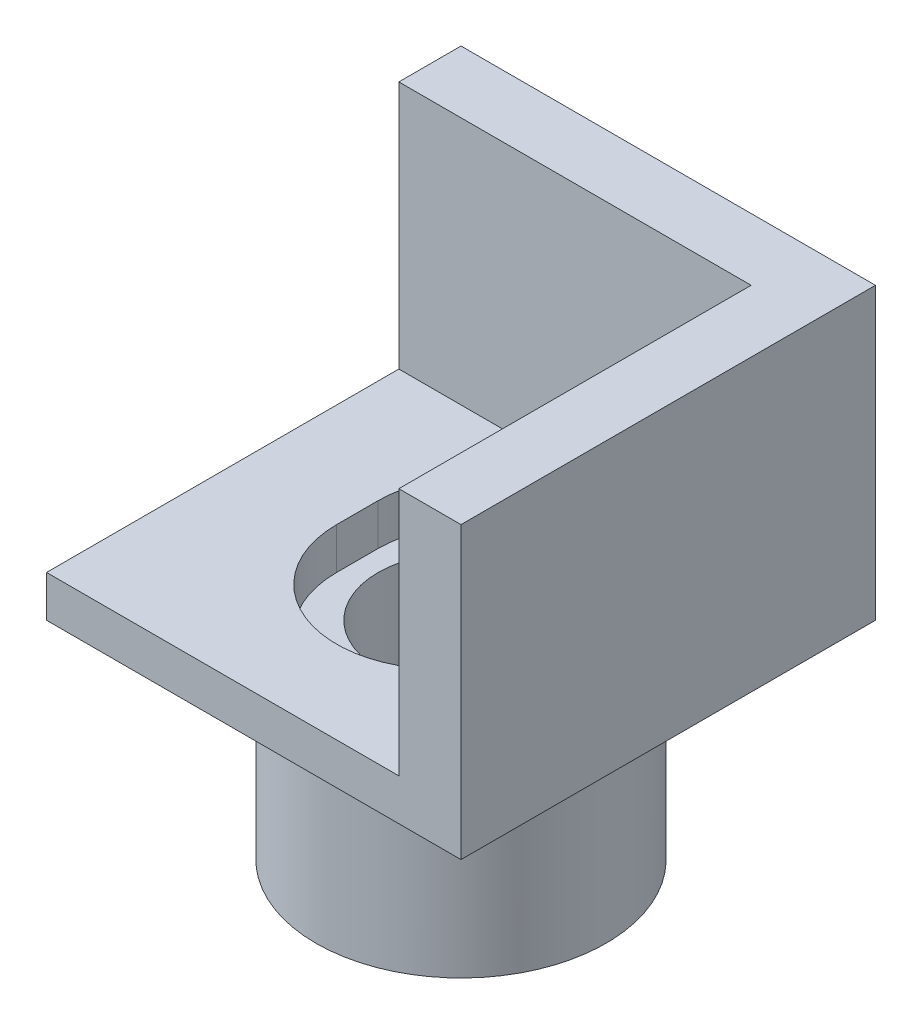
ISO-10303-21;
HEADER;
FILE_DESCRIPTION(('STEP AP214'),'2;1');
FILE_NAME('part.step','',(''),(''),'','','');
FILE_SCHEMA(('AUTOMOTIVE_DESIGN { 1 0 10303 214 1 1 1 1 }'));
ENDSEC;
DATA;
#1=APPLICATION_CONTEXT('core data for automotive mechanical design processes');
#2=APPLICATION_PROTOCOL_DEFINITION('international standard','automotive_design',2000,#1);
#3=PRODUCT_CONTEXT('',#1,'mechanical');
#4=PRODUCT('Part','Part','',(#3));
#5=PRODUCT_RELATED_PRODUCT_CATEGORY('part','',(#4));
#6=PRODUCT_DEFINITION_FORMATION('','',#4);
#7=PRODUCT_DEFINITION_CONTEXT('part definition',#1,'design');
#8=PRODUCT_DEFINITION('design','',#6,#7);
#9=PRODUCT_DEFINITION_SHAPE('','',#8);
#10=(LENGTH_UNIT() NAMED_UNIT(*) SI_UNIT(.MILLI.,.METRE.));
#11=(NAMED_UNIT(*) PLANE_ANGLE_UNIT() SI_UNIT($,.RADIAN.));
#12=(NAMED_UNIT(*) SI_UNIT($,.STERADIAN.) SOLID_ANGLE_UNIT());
#13=UNCERTAINTY_MEASURE_WITH_UNIT(LENGTH_MEASURE(1.E-05),#10,'distance_accuracy_value','');
#14=(GEOMETRIC_REPRESENTATION_CONTEXT(3) GLOBAL_UNCERTAINTY_ASSIGNED_CONTEXT((#13)) GLOBAL_UNIT_ASSIGNED_CONTEXT((#10,
#11,#12)) REPRESENTATION_CONTEXT('',''));
#15=CARTESIAN_POINT('',(0.,0.,0.));
#16=DIRECTION('',(0.,0.,1.));
#17=DIRECTION('',(1.,0.,0.));
#18=AXIS2_PLACEMENT_3D('',#15,#16,#17);
#19=CARTESIAN_POINT('',(-5.,1.,-5.));
#20=DIRECTION('',(1.,0.,0.));
#21=DIRECTION('',(0.,0.,-1.));
#22=AXIS2_PLACEMENT_3D('',#19,#20,#21);
#23=PLANE('',#22);
#24=DIRECTION('',(0.,0.,1.));
#25=VECTOR('',#24,1.);
#26=CARTESIAN_POINT('',(-5.,0.,-5.));
#27=LINE('',#26,#25);
#28=CARTESIAN_POINT('',(-5.,0.,-5.));
#29=VERTEX_POINT('',#28);
#30=CARTESIAN_POINT('',(-5.,0.,5.));
#31=VERTEX_POINT('',#30);
#32=EDGE_CURVE('E183',#29,#31,#27,.T.);
#33=ORIENTED_EDGE('',*,*,#32,.T.);
#34=DIRECTION('',(0.,-1.,0.));
#35=VECTOR('',#34,1.);
#36=CARTESIAN_POINT('',(-5.,1.,5.));
#37=LINE('',#36,#35);
#38=CARTESIAN_POINT('',(-5.,1.,5.));
#39=VERTEX_POINT('',#38);
#40=EDGE_CURVE('E125',#39,#31,#37,.T.);
#41=ORIENTED_EDGE('',*,*,#40,.F.);
#42=DIRECTION('',(0.,0.,1.));
#43=VECTOR('',#42,1.);
#44=CARTESIAN_POINT('',(-5.,1.,-5.));
#45=LINE('',#44,#43);
#46=CARTESIAN_POINT('',(-5.,1.,-3.5));
#47=VERTEX_POINT('',#46);
#48=EDGE_CURVE('E190',#47,#39,#45,.T.);
#49=ORIENTED_EDGE('',*,*,#48,.F.);
#50=DIRECTION('',(0.,-1.,0.));
#51=VECTOR('',#50,1.);
#52=CARTESIAN_POINT('',(-5.,7.,-3.5));
#53=LINE('',#52,#51);
#54=CARTESIAN_POINT('',(-5.,7.,-3.5));
#55=VERTEX_POINT('',#54);
#56=EDGE_CURVE('E157',#55,#47,#53,.T.);
#57=ORIENTED_EDGE('',*,*,#56,.F.);
#58=DIRECTION('',(0.,0.,1.));
#59=VECTOR('',#58,1.);
#60=CARTESIAN_POINT('',(-5.,7.,-3.5));
#61=LINE('',#60,#59);
#62=CARTESIAN_POINT('',(-5.,7.,-5.));
#63=VERTEX_POINT('',#62);
#64=EDGE_CURVE('E146',#63,#55,#61,.T.);
#65=ORIENTED_EDGE('',*,*,#64,.F.);
#66=DIRECTION('',(0.,-1.,0.));
#67=VECTOR('',#66,1.);
#68=CARTESIAN_POINT('',(-5.,1.,-5.));
#69=LINE('',#68,#67);
#70=EDGE_CURVE('E194',#63,#29,#69,.T.);
#71=ORIENTED_EDGE('',*,*,#70,.T.);
#72=EDGE_LOOP('',(#33,#41,#49,#57,#65,#71));
#73=FACE_BOUND('',#72,.T.);
#74=ADVANCED_FACE('F34',(#73),#23,.F.);
#75=CARTESIAN_POINT('',(-5.,1.,5.));
#76=DIRECTION('',(0.,0.,-1.));
#77=DIRECTION('',(-1.,0.,0.));
#78=AXIS2_PLACEMENT_3D('',#75,#76,#77);
#79=PLANE('',#78);
#80=DIRECTION('',(1.,0.,0.));
#81=VECTOR('',#80,1.);
#82=CARTESIAN_POINT('',(-5.,0.,5.));
#83=LINE('',#82,#81);
#84=CARTESIAN_POINT('',(5.,0.,5.));
#85=VERTEX_POINT('',#84);
#86=EDGE_CURVE('E122',#31,#85,#83,.T.);
#87=ORIENTED_EDGE('',*,*,#86,.T.);
#88=DIRECTION('',(0.,-1.,0.));
#89=VECTOR('',#88,1.);
#90=CARTESIAN_POINT('',(5.,1.,5.));
#91=LINE('',#90,#89);
#92=CARTESIAN_POINT('',(5.,7.,5.));
#93=VERTEX_POINT('',#92);
#94=EDGE_CURVE('E115',#93,#85,#91,.T.);
#95=ORIENTED_EDGE('',*,*,#94,.F.);
#96=DIRECTION('',(1.,0.,0.));
#97=VECTOR('',#96,1.);
#98=CARTESIAN_POINT('',(5.,7.,5.));
#99=LINE('',#98,#97);
#100=CARTESIAN_POINT('',(3.5,7.,5.));
#101=VERTEX_POINT('',#100);
#102=EDGE_CURVE('E120',#101,#93,#99,.T.);
#103=ORIENTED_EDGE('',*,*,#102,.F.);
#104=DIRECTION('',(0.,-1.,0.));
#105=VECTOR('',#104,1.);
#106=CARTESIAN_POINT('',(3.5,7.,5.));
#107=LINE('',#106,#105);
#108=CARTESIAN_POINT('',(3.5,1.,5.));
#109=VERTEX_POINT('',#108);
#110=EDGE_CURVE('E151',#101,#109,#107,.T.);
#111=ORIENTED_EDGE('',*,*,#110,.T.);
#112=DIRECTION('',(1.,0.,0.));
#113=VECTOR('',#112,1.);
#114=CARTESIAN_POINT('',(-5.,1.,5.));
#115=LINE('',#114,#113);
#116=EDGE_CURVE('E48',#39,#109,#115,.T.);
#117=ORIENTED_EDGE('',*,*,#116,.F.);
#118=ORIENTED_EDGE('',*,*,#40,.T.);
#119=EDGE_LOOP('',(#87,#95,#103,#111,#117,#118));
#120=FACE_BOUND('',#119,.T.);
#121=ADVANCED_FACE('F117',(#120),#79,.F.);
#122=CARTESIAN_POINT('',(5.,1.,-5.));
#123=DIRECTION('',(-1.,0.,0.));
#124=DIRECTION('',(0.,0.,1.));
#125=AXIS2_PLACEMENT_3D('',#122,#123,#124);
#126=PLANE('',#125);
#127=DIRECTION('',(0.,0.,-1.));
#128=VECTOR('',#127,1.);
#129=CARTESIAN_POINT('',(5.,0.,-5.));
#130=LINE('',#129,#128);
#131=CARTESIAN_POINT('',(5.,0.,-5.));
#132=VERTEX_POINT('',#131);
#133=EDGE_CURVE('E198',#85,#132,#130,.T.);
#134=ORIENTED_EDGE('',*,*,#133,.T.);
#135=DIRECTION('',(0.,-1.,0.));
#136=VECTOR('',#135,1.);
#137=CARTESIAN_POINT('',(5.,1.,-5.));
#138=LINE('',#137,#136);
#139=CARTESIAN_POINT('',(5.,7.,-5.));
#140=VERTEX_POINT('',#139);
#141=EDGE_CURVE('E126',#140,#132,#138,.T.);
#142=ORIENTED_EDGE('',*,*,#141,.F.);
#143=DIRECTION('',(0.,0.,-1.));
#144=VECTOR('',#143,1.);
#145=CARTESIAN_POINT('',(5.,7.,5.));
#146=LINE('',#145,#144);
#147=EDGE_CURVE('E129',#93,#140,#146,.T.);
#148=ORIENTED_EDGE('',*,*,#147,.F.);
#149=ORIENTED_EDGE('',*,*,#94,.T.);
#150=EDGE_LOOP('',(#134,#142,#148,#149));
#151=FACE_BOUND('',#150,.T.);
#152=ADVANCED_FACE('F130',(#151),#126,.F.);
#153=CARTESIAN_POINT('',(-5.,1.,-5.));
#154=DIRECTION('',(0.,0.,1.));
#155=DIRECTION('',(1.,0.,0.));
#156=AXIS2_PLACEMENT_3D('',#153,#154,#155);
#157=PLANE('',#156);
#158=DIRECTION('',(-1.,0.,0.));
#159=VECTOR('',#158,1.);
#160=CARTESIAN_POINT('',(-5.,0.,-5.));
#161=LINE('',#160,#159);
#162=EDGE_CURVE('E192',#132,#29,#161,.T.);
#163=ORIENTED_EDGE('',*,*,#162,.T.);
#164=ORIENTED_EDGE('',*,*,#70,.F.);
#165=DIRECTION('',(-1.,0.,0.));
#166=VECTOR('',#165,1.);
#167=CARTESIAN_POINT('',(5.,7.,-5.));
#168=LINE('',#167,#166);
#169=EDGE_CURVE('E135',#140,#63,#168,.T.);
#170=ORIENTED_EDGE('',*,*,#169,.F.);
#171=ORIENTED_EDGE('',*,*,#141,.T.);
#172=EDGE_LOOP('',(#163,#164,#170,#171));
#173=FACE_BOUND('',#172,.T.);
#174=ADVANCED_FACE('F261',(#173),#157,.F.);
#175=CARTESIAN_POINT('',(0.,1.,0.));
#176=DIRECTION('',(0.,1.,0.));
#177=DIRECTION('',(0.,0.,1.));
#178=AXIS2_PLACEMENT_3D('',#175,#176,#177);
#179=PLANE('',#178);
#180=DIRECTION('',(0.,0.,1.));
#181=VECTOR('',#180,1.);
#182=CARTESIAN_POINT('',(3.5,1.,5.));
#183=LINE('',#182,#181);
#184=CARTESIAN_POINT('',(3.5,1.,-3.5));
#185=VERTEX_POINT('',#184);
#186=EDGE_CURVE('E141',#185,#109,#183,.T.);
#187=ORIENTED_EDGE('',*,*,#186,.F.);
#188=DIRECTION('',(1.,0.,0.));
#189=VECTOR('',#188,1.);
#190=CARTESIAN_POINT('',(3.5,1.,-3.5));
#191=LINE('',#190,#189);
#192=EDGE_CURVE('E53',#47,#185,#191,.T.);
#193=ORIENTED_EDGE('',*,*,#192,.F.);
#194=ORIENTED_EDGE('',*,*,#48,.T.);
#195=ORIENTED_EDGE('',*,*,#116,.T.);
#196=EDGE_LOOP('',(#187,#193,#194,#195));
#197=FACE_BOUND('',#196,.T.);
#198=CARTESIAN_POINT('',(0.,1.,-0.5));
#199=DIRECTION('',(0.,1.,0.));
#200=DIRECTION('',(0.,0.,1.));
#201=AXIS2_PLACEMENT_3D('',#198,#199,#200);
#202=CIRCLE('',#201,2.5);
#203=CARTESIAN_POINT('',(2.5,1.,-0.5));
#204=VERTEX_POINT('',#203);
#205=CARTESIAN_POINT('',(-2.5,1.,-0.5));
#206=VERTEX_POINT('',#205);
#207=EDGE_CURVE('E169',#204,#206,#202,.T.);
#208=ORIENTED_EDGE('',*,*,#207,.F.);
#209=DIRECTION('',(0.,0.,-1.));
#210=VECTOR('',#209,1.);
#211=CARTESIAN_POINT('',(2.5,1.,-0.5));
#212=LINE('',#211,#210);
#213=CARTESIAN_POINT('',(2.5,1.,0.5));
#214=VERTEX_POINT('',#213);
#215=EDGE_CURVE('E177',#214,#204,#212,.T.);
#216=ORIENTED_EDGE('',*,*,#215,.F.);
#217=CARTESIAN_POINT('',(0.,1.,0.5));
#218=DIRECTION('',(0.,1.,0.));
#219=DIRECTION('',(0.,0.,1.));
#220=AXIS2_PLACEMENT_3D('',#217,#218,#219);
#221=CIRCLE('',#220,2.5);
#222=CARTESIAN_POINT('',(-2.5,1.,0.5));
#223=VERTEX_POINT('',#222);
#224=EDGE_CURVE('E174',#223,#214,#221,.T.);
#225=ORIENTED_EDGE('',*,*,#224,.F.);
#226=DIRECTION('',(0.,0.,1.));
#227=VECTOR('',#226,1.);
#228=CARTESIAN_POINT('',(-2.5,1.,-0.5));
#229=LINE('',#228,#227);
#230=EDGE_CURVE('E171',#206,#223,#229,.T.);
#231=ORIENTED_EDGE('',*,*,#230,.F.);
#232=EDGE_LOOP('',(#208,#216,#225,#231));
#233=FACE_BOUND('',#232,.T.);
#234=ADVANCED_FACE('F228',(#197,#233),#179,.T.);
#235=CARTESIAN_POINT('',(0.,0.,0.));
#236=DIRECTION('',(0.,1.,0.));
#237=DIRECTION('',(0.,0.,1.));
#238=AXIS2_PLACEMENT_3D('',#235,#236,#237);
#239=PLANE('',#238);
#240=CARTESIAN_POINT('',(0.,0.,0.));
#241=DIRECTION('',(0.,1.,0.));
#242=DIRECTION('',(0.,0.,1.));
#243=AXIS2_PLACEMENT_3D('',#240,#241,#242);
#244=CIRCLE('',#243,3.5);
#245=CARTESIAN_POINT('',(0.,0.,3.5));
#246=VERTEX_POINT('',#245);
#247=EDGE_CURVE('E11',#246,#246,#244,.F.);
#248=ORIENTED_EDGE('',*,*,#247,.F.);
#249=EDGE_LOOP('',(#248));
#250=FACE_BOUND('',#249,.T.);
#251=ORIENTED_EDGE('',*,*,#32,.F.);
#252=ORIENTED_EDGE('',*,*,#162,.F.);
#253=ORIENTED_EDGE('',*,*,#133,.F.);
#254=ORIENTED_EDGE('',*,*,#86,.F.);
#255=EDGE_LOOP('',(#251,#252,#253,#254));
#256=FACE_BOUND('',#255,.T.);
#257=ADVANCED_FACE('F252',(#250,#256),#239,.F.);
#258=CARTESIAN_POINT('',(0.,-0.5,-0.5));
#259=DIRECTION('',(0.,1.,0.));
#260=DIRECTION('',(0.,0.,1.));
#261=AXIS2_PLACEMENT_3D('',#258,#259,#260);
#262=CYLINDRICAL_SURFACE('',#261,2.5);
#263=DIRECTION('',(0.,1.,0.));
#264=VECTOR('',#263,1.);
#265=CARTESIAN_POINT('',(2.5,-0.5,-0.5));
#266=LINE('',#265,#264);
#267=CARTESIAN_POINT('',(2.5,0.,-0.5));
#268=VERTEX_POINT('',#267);
#269=EDGE_CURVE('E181',#268,#204,#266,.T.);
#270=ORIENTED_EDGE('',*,*,#269,.T.);
#271=ORIENTED_EDGE('',*,*,#207,.T.);
#272=DIRECTION('',(0.,1.,0.));
#273=VECTOR('',#272,1.);
#274=CARTESIAN_POINT('',(-2.5,-0.5,-0.5));
#275=LINE('',#274,#273);
#276=CARTESIAN_POINT('',(-2.5,0.,-0.5));
#277=VERTEX_POINT('',#276);
#278=EDGE_CURVE('E180',#277,#206,#275,.T.);
#279=ORIENTED_EDGE('',*,*,#278,.F.);
#280=CARTESIAN_POINT('',(0.,0.,-0.5));
#281=DIRECTION('',(0.,1.,0.));
#282=DIRECTION('',(0.,0.,1.));
#283=AXIS2_PLACEMENT_3D('',#280,#281,#282);
#284=CIRCLE('',#283,2.5);
#285=EDGE_CURVE('E41',#268,#277,#284,.T.);
#286=ORIENTED_EDGE('',*,*,#285,.F.);
#287=EDGE_LOOP('',(#270,#271,#279,#286));
#288=FACE_BOUND('',#287,.T.);
#289=ADVANCED_FACE('F219',(#288),#262,.F.);
#290=CARTESIAN_POINT('',(2.5,-0.5,-0.5));
#291=DIRECTION('',(1.,0.,0.));
#292=DIRECTION('',(0.,0.,-1.));
#293=AXIS2_PLACEMENT_3D('',#290,#291,#292);
#294=PLANE('',#293);
#295=DIRECTION('',(0.,1.,0.));
#296=VECTOR('',#295,1.);
#297=CARTESIAN_POINT('',(2.5,-0.5,0.5));
#298=LINE('',#297,#296);
#299=CARTESIAN_POINT('',(2.5,0.,0.5));
#300=VERTEX_POINT('',#299);
#301=EDGE_CURVE('E184',#300,#214,#298,.T.);
#302=ORIENTED_EDGE('',*,*,#301,.T.);
#303=ORIENTED_EDGE('',*,*,#215,.T.);
#304=ORIENTED_EDGE('',*,*,#269,.F.);
#305=DIRECTION('',(0.,0.,-1.));
#306=VECTOR('',#305,1.);
#307=CARTESIAN_POINT('',(2.5,0.,0.));
#308=LINE('',#307,#306);
#309=EDGE_CURVE('E211',#300,#268,#308,.T.);
#310=ORIENTED_EDGE('',*,*,#309,.F.);
#311=EDGE_LOOP('',(#302,#303,#304,#310));
#312=FACE_BOUND('',#311,.T.);
#313=ADVANCED_FACE('F221',(#312),#294,.F.);
#314=CARTESIAN_POINT('',(0.,-0.5,0.5));
#315=DIRECTION('',(0.,1.,0.));
#316=DIRECTION('',(0.,0.,1.));
#317=AXIS2_PLACEMENT_3D('',#314,#315,#316);
#318=CYLINDRICAL_SURFACE('',#317,2.5);
#319=DIRECTION('',(0.,1.,0.));
#320=VECTOR('',#319,1.);
#321=CARTESIAN_POINT('',(-2.5,-0.5,0.5));
#322=LINE('',#321,#320);
#323=CARTESIAN_POINT('',(-2.5,0.,0.5));
#324=VERTEX_POINT('',#323);
#325=EDGE_CURVE('E186',#324,#223,#322,.T.);
#326=ORIENTED_EDGE('',*,*,#325,.T.);
#327=ORIENTED_EDGE('',*,*,#224,.T.);
#328=ORIENTED_EDGE('',*,*,#301,.F.);
#329=CARTESIAN_POINT('',(0.,0.,0.5));
#330=DIRECTION('',(0.,1.,0.));
#331=DIRECTION('',(0.,0.,1.));
#332=AXIS2_PLACEMENT_3D('',#329,#330,#331);
#333=CIRCLE('',#332,2.5);
#334=EDGE_CURVE('E208',#324,#300,#333,.T.);
#335=ORIENTED_EDGE('',*,*,#334,.F.);
#336=EDGE_LOOP('',(#326,#327,#328,#335));
#337=FACE_BOUND('',#336,.T.);
#338=ADVANCED_FACE('F233',(#337),#318,.F.);
#339=CARTESIAN_POINT('',(-2.5,-0.5,-0.5));
#340=DIRECTION('',(-1.,0.,0.));
#341=DIRECTION('',(0.,0.,1.));
#342=AXIS2_PLACEMENT_3D('',#339,#340,#341);
#343=PLANE('',#342);
#344=ORIENTED_EDGE('',*,*,#278,.T.);
#345=ORIENTED_EDGE('',*,*,#230,.T.);
#346=ORIENTED_EDGE('',*,*,#325,.F.);
#347=DIRECTION('',(0.,0.,1.));
#348=VECTOR('',#347,1.);
#349=CARTESIAN_POINT('',(-2.5,0.,0.));
#350=LINE('',#349,#348);
#351=EDGE_CURVE('E205',#277,#324,#350,.T.);
#352=ORIENTED_EDGE('',*,*,#351,.F.);
#353=EDGE_LOOP('',(#344,#345,#346,#352));
#354=FACE_BOUND('',#353,.T.);
#355=ADVANCED_FACE('F230',(#354),#343,.F.);
#356=CARTESIAN_POINT('',(0.,0.,0.));
#357=DIRECTION('',(0.,-1.,0.));
#358=DIRECTION('',(0.,0.,-1.));
#359=AXIS2_PLACEMENT_3D('',#356,#357,#358);
#360=PLANE('',#359);
#361=CARTESIAN_POINT('',(0.,0.,0.));
#362=DIRECTION('',(0.,1.,0.));
#363=DIRECTION('',(0.,0.,1.));
#364=AXIS2_PLACEMENT_3D('',#361,#362,#363);
#365=CIRCLE('',#364,2.);
#366=CARTESIAN_POINT('',(0.,0.,2.));
#367=VERTEX_POINT('',#366);
#368=EDGE_CURVE('E160',#367,#367,#365,.T.);
#369=ORIENTED_EDGE('',*,*,#368,.F.);
#370=EDGE_LOOP('',(#369));
#371=FACE_BOUND('',#370,.T.);
#372=ORIENTED_EDGE('',*,*,#309,.T.);
#373=ORIENTED_EDGE('',*,*,#285,.T.);
#374=ORIENTED_EDGE('',*,*,#351,.T.);
#375=ORIENTED_EDGE('',*,*,#334,.T.);
#376=EDGE_LOOP('',(#372,#373,#374,#375));
#377=FACE_BOUND('',#376,.T.);
#378=ADVANCED_FACE('F215',(#371,#377),#360,.F.);
#379=CARTESIAN_POINT('',(0.,-5.,0.));
#380=DIRECTION('',(0.,1.,0.));
#381=DIRECTION('',(0.,0.,1.));
#382=AXIS2_PLACEMENT_3D('',#379,#380,#381);
#383=CYLINDRICAL_SURFACE('',#382,3.5);
#384=CARTESIAN_POINT('',(0.,-5.,0.));
#385=DIRECTION('',(0.,-1.,0.));
#386=DIRECTION('',(0.,0.,-1.));
#387=AXIS2_PLACEMENT_3D('',#384,#385,#386);
#388=CIRCLE('',#387,3.5);
#389=CARTESIAN_POINT('',(0.,-5.,-3.5));
#390=VERTEX_POINT('',#389);
#391=EDGE_CURVE('E164',#390,#390,#388,.T.);
#392=ORIENTED_EDGE('',*,*,#391,.F.);
#393=EDGE_LOOP('',(#392));
#394=FACE_BOUND('',#393,.T.);
#395=ORIENTED_EDGE('',*,*,#247,.T.);
#396=EDGE_LOOP('',(#395));
#397=FACE_BOUND('',#396,.T.);
#398=ADVANCED_FACE('F300',(#394,#397),#383,.T.);
#399=CARTESIAN_POINT('',(0.,-5.,0.));
#400=DIRECTION('',(0.,-1.,0.));
#401=DIRECTION('',(0.,0.,-1.));
#402=AXIS2_PLACEMENT_3D('',#399,#400,#401);
#403=PLANE('',#402);
#404=CARTESIAN_POINT('',(0.,-5.,0.));
#405=DIRECTION('',(0.,1.,0.));
#406=DIRECTION('',(0.,0.,1.));
#407=AXIS2_PLACEMENT_3D('',#404,#405,#406);
#408=CIRCLE('',#407,2.);
#409=CARTESIAN_POINT('',(0.,-5.,2.));
#410=VERTEX_POINT('',#409);
#411=EDGE_CURVE('E161',#410,#410,#408,.T.);
#412=ORIENTED_EDGE('',*,*,#411,.T.);
#413=EDGE_LOOP('',(#412));
#414=FACE_BOUND('',#413,.T.);
#415=ORIENTED_EDGE('',*,*,#391,.T.);
#416=EDGE_LOOP('',(#415));
#417=FACE_BOUND('',#416,.T.);
#418=ADVANCED_FACE('F305',(#414,#417),#403,.T.);
#419=CARTESIAN_POINT('',(0.,-5.,0.));
#420=DIRECTION('',(0.,1.,0.));
#421=DIRECTION('',(0.,0.,1.));
#422=AXIS2_PLACEMENT_3D('',#419,#420,#421);
#423=CYLINDRICAL_SURFACE('',#422,2.);
#424=ORIENTED_EDGE('',*,*,#411,.F.);
#425=EDGE_LOOP('',(#424));
#426=FACE_BOUND('',#425,.T.);
#427=ORIENTED_EDGE('',*,*,#368,.T.);
#428=EDGE_LOOP('',(#427));
#429=FACE_BOUND('',#428,.T.);
#430=ADVANCED_FACE('F322',(#426,#429),#423,.F.);
#431=CARTESIAN_POINT('',(3.5,7.,-3.5));
#432=DIRECTION('',(0.,0.,-1.));
#433=DIRECTION('',(-1.,0.,0.));
#434=AXIS2_PLACEMENT_3D('',#431,#432,#433);
#435=PLANE('',#434);
#436=ORIENTED_EDGE('',*,*,#192,.T.);
#437=DIRECTION('',(0.,-1.,0.));
#438=VECTOR('',#437,1.);
#439=CARTESIAN_POINT('',(3.5,7.,-3.5));
#440=LINE('',#439,#438);
#441=CARTESIAN_POINT('',(3.5,7.,-3.5));
#442=VERTEX_POINT('',#441);
#443=EDGE_CURVE('E154',#442,#185,#440,.T.);
#444=ORIENTED_EDGE('',*,*,#443,.F.);
#445=DIRECTION('',(1.,0.,0.));
#446=VECTOR('',#445,1.);
#447=CARTESIAN_POINT('',(3.5,7.,-3.5));
#448=LINE('',#447,#446);
#449=EDGE_CURVE('E148',#55,#442,#448,.T.);
#450=ORIENTED_EDGE('',*,*,#449,.F.);
#451=ORIENTED_EDGE('',*,*,#56,.T.);
#452=EDGE_LOOP('',(#436,#444,#450,#451));
#453=FACE_BOUND('',#452,.T.);
#454=ADVANCED_FACE('F257',(#453),#435,.F.);
#455=CARTESIAN_POINT('',(3.5,7.,5.));
#456=DIRECTION('',(1.,0.,0.));
#457=DIRECTION('',(0.,0.,-1.));
#458=AXIS2_PLACEMENT_3D('',#455,#456,#457);
#459=PLANE('',#458);
#460=ORIENTED_EDGE('',*,*,#186,.T.);
#461=ORIENTED_EDGE('',*,*,#110,.F.);
#462=DIRECTION('',(0.,0.,1.));
#463=VECTOR('',#462,1.);
#464=CARTESIAN_POINT('',(3.5,7.,5.));
#465=LINE('',#464,#463);
#466=EDGE_CURVE('E139',#442,#101,#465,.T.);
#467=ORIENTED_EDGE('',*,*,#466,.F.);
#468=ORIENTED_EDGE('',*,*,#443,.T.);
#469=EDGE_LOOP('',(#460,#461,#467,#468));
#470=FACE_BOUND('',#469,.T.);
#471=ADVANCED_FACE('F254',(#470),#459,.F.);
#472=CARTESIAN_POINT('',(0.,7.,0.));
#473=DIRECTION('',(0.,-1.,0.));
#474=DIRECTION('',(0.,0.,-1.));
#475=AXIS2_PLACEMENT_3D('',#472,#473,#474);
#476=PLANE('',#475);
#477=ORIENTED_EDGE('',*,*,#102,.T.);
#478=ORIENTED_EDGE('',*,*,#147,.T.);
#479=ORIENTED_EDGE('',*,*,#169,.T.);
#480=ORIENTED_EDGE('',*,*,#64,.T.);
#481=ORIENTED_EDGE('',*,*,#449,.T.);
#482=ORIENTED_EDGE('',*,*,#466,.T.);
#483=EDGE_LOOP('',(#477,#478,#479,#480,#481,#482));
#484=FACE_BOUND('',#483,.T.);
#485=ADVANCED_FACE('F137',(#484),#476,.F.);
#486=CLOSED_SHELL('',(#74,#121,#152,#174,#234,#257,#289,#313,#338,#355,#378,#398,#418,#430,#454,
#471,#485));
#487=MANIFOLD_SOLID_BREP('B2',#486);
#488=ADVANCED_BREP_SHAPE_REPRESENTATION('',(#18,#487),#14);
#489=SHAPE_DEFINITION_REPRESENTATION(#9,#488);
ENDSEC;
END-ISO-10303-21;
